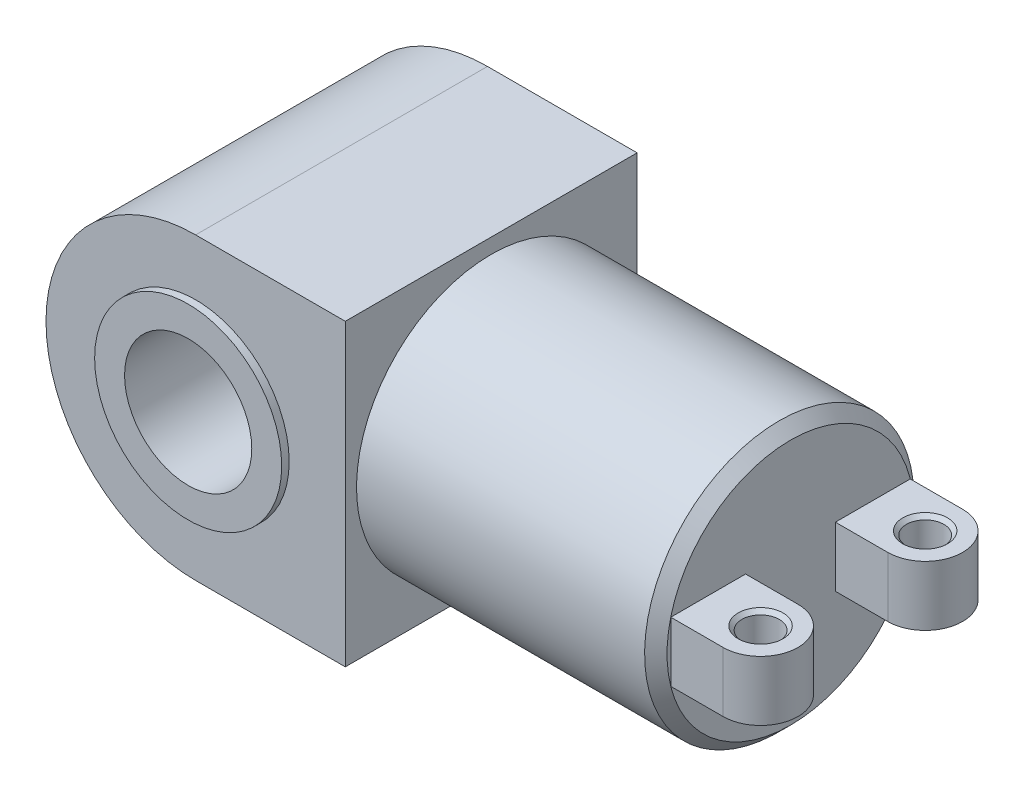
ISO-10303-21;
HEADER;
FILE_DESCRIPTION(('STEP AP214'),'2;1');
FILE_NAME('part.step','',(''),(''),'','','');
FILE_SCHEMA(('AUTOMOTIVE_DESIGN { 1 0 10303 214 1 1 1 1 }'));
ENDSEC;
DATA;
#1=APPLICATION_CONTEXT('core data for automotive mechanical design processes');
#2=APPLICATION_PROTOCOL_DEFINITION('international standard','automotive_design',2000,#1);
#3=PRODUCT_CONTEXT('',#1,'mechanical');
#4=PRODUCT('Part','Part','',(#3));
#5=PRODUCT_RELATED_PRODUCT_CATEGORY('part','',(#4));
#6=PRODUCT_DEFINITION_FORMATION('','',#4);
#7=PRODUCT_DEFINITION_CONTEXT('part definition',#1,'design');
#8=PRODUCT_DEFINITION('design','',#6,#7);
#9=PRODUCT_DEFINITION_SHAPE('','',#8);
#10=(LENGTH_UNIT() NAMED_UNIT(*) SI_UNIT(.MILLI.,.METRE.));
#11=(NAMED_UNIT(*) PLANE_ANGLE_UNIT() SI_UNIT($,.RADIAN.));
#12=(NAMED_UNIT(*) SI_UNIT($,.STERADIAN.) SOLID_ANGLE_UNIT());
#13=UNCERTAINTY_MEASURE_WITH_UNIT(LENGTH_MEASURE(1.E-05),#10,'distance_accuracy_value','');
#14=(GEOMETRIC_REPRESENTATION_CONTEXT(3) GLOBAL_UNCERTAINTY_ASSIGNED_CONTEXT((#13)) GLOBAL_UNIT_ASSIGNED_CONTEXT((#10,
#11,#12)) REPRESENTATION_CONTEXT('',''));
#15=CARTESIAN_POINT('',(0.,0.,0.));
#16=DIRECTION('',(0.,0.,1.));
#17=DIRECTION('',(1.,0.,0.));
#18=AXIS2_PLACEMENT_3D('',#15,#16,#17);
#19=CARTESIAN_POINT('',(300.,0.,0.));
#20=DIRECTION('',(1.,0.,0.));
#21=DIRECTION('',(0.,1.,0.));
#22=AXIS2_PLACEMENT_3D('',#19,#20,#21);
#23=PLANE('',#22);
#24=CARTESIAN_POINT('',(300.,0.,0.));
#25=DIRECTION('',(1.,0.,0.));
#26=DIRECTION('',(0.,1.,0.));
#27=AXIS2_PLACEMENT_3D('',#24,#25,#26);
#28=CIRCLE('',#27,82.5000000000002);
#29=CARTESIAN_POINT('',(300.,82.5000000000002,0.));
#30=VERTEX_POINT('',#29);
#31=EDGE_CURVE('E208',#30,#30,#28,.T.);
#32=ORIENTED_EDGE('',*,*,#31,.T.);
#33=EDGE_LOOP('',(#32));
#34=FACE_BOUND('',#33,.T.);
#35=DIRECTION('',(0.,0.,1.));
#36=VECTOR('',#35,1.);
#37=CARTESIAN_POINT('',(300.,-20.,80.));
#38=LINE('',#37,#36);
#39=CARTESIAN_POINT('',(300.,-20.,30.));
#40=VERTEX_POINT('',#39);
#41=CARTESIAN_POINT('',(300.,-20.,80.));
#42=VERTEX_POINT('',#41);
#43=EDGE_CURVE('E65',#40,#42,#38,.T.);
#44=ORIENTED_EDGE('',*,*,#43,.T.);
#45=DIRECTION('',(0.,-1.,0.));
#46=VECTOR('',#45,1.);
#47=CARTESIAN_POINT('',(300.,20.,80.));
#48=LINE('',#47,#46);
#49=CARTESIAN_POINT('',(300.,20.,80.));
#50=VERTEX_POINT('',#49);
#51=EDGE_CURVE('E199',#50,#42,#48,.T.);
#52=ORIENTED_EDGE('',*,*,#51,.F.);
#53=DIRECTION('',(0.,0.,1.));
#54=VECTOR('',#53,1.);
#55=CARTESIAN_POINT('',(300.,20.,80.));
#56=LINE('',#55,#54);
#57=CARTESIAN_POINT('',(300.,20.,30.));
#58=VERTEX_POINT('',#57);
#59=EDGE_CURVE('E166',#58,#50,#56,.T.);
#60=ORIENTED_EDGE('',*,*,#59,.F.);
#61=DIRECTION('',(0.,-1.,0.));
#62=VECTOR('',#61,1.);
#63=CARTESIAN_POINT('',(300.,20.,30.));
#64=LINE('',#63,#62);
#65=EDGE_CURVE('E179',#58,#40,#64,.T.);
#66=ORIENTED_EDGE('',*,*,#65,.T.);
#67=EDGE_LOOP('',(#44,#52,#60,#66));
#68=FACE_BOUND('',#67,.T.);
#69=DIRECTION('',(0.,0.,1.));
#70=VECTOR('',#69,1.);
#71=CARTESIAN_POINT('',(300.,-20.,-80.));
#72=LINE('',#71,#70);
#73=CARTESIAN_POINT('',(300.,-20.,-80.));
#74=VERTEX_POINT('',#73);
#75=CARTESIAN_POINT('',(300.,-20.,-30.));
#76=VERTEX_POINT('',#75);
#77=EDGE_CURVE('E57',#74,#76,#72,.T.);
#78=ORIENTED_EDGE('',*,*,#77,.T.);
#79=DIRECTION('',(0.,-1.,0.));
#80=VECTOR('',#79,1.);
#81=CARTESIAN_POINT('',(300.,20.,-30.));
#82=LINE('',#81,#80);
#83=CARTESIAN_POINT('',(300.,20.,-30.));
#84=VERTEX_POINT('',#83);
#85=EDGE_CURVE('E137',#84,#76,#82,.T.);
#86=ORIENTED_EDGE('',*,*,#85,.F.);
#87=DIRECTION('',(0.,0.,1.));
#88=VECTOR('',#87,1.);
#89=CARTESIAN_POINT('',(300.,20.,-80.));
#90=LINE('',#89,#88);
#91=CARTESIAN_POINT('',(300.,20.,-80.));
#92=VERTEX_POINT('',#91);
#93=EDGE_CURVE('E144',#92,#84,#90,.T.);
#94=ORIENTED_EDGE('',*,*,#93,.F.);
#95=DIRECTION('',(0.,-1.,0.));
#96=VECTOR('',#95,1.);
#97=CARTESIAN_POINT('',(300.,20.,-80.));
#98=LINE('',#97,#96);
#99=EDGE_CURVE('E597',#92,#74,#98,.T.);
#100=ORIENTED_EDGE('',*,*,#99,.T.);
#101=EDGE_LOOP('',(#78,#86,#94,#100));
#102=FACE_BOUND('',#101,.T.);
#103=ADVANCED_FACE('F40',(#34,#68,#102),#23,.T.);
#104=CARTESIAN_POINT('',(0.,0.,97.5));
#105=DIRECTION('',(0.,0.,1.));
#106=DIRECTION('',(1.,0.,0.));
#107=AXIS2_PLACEMENT_3D('',#104,#105,#106);
#108=PLANE('',#107);
#109=CARTESIAN_POINT('',(0.,0.,97.5));
#110=DIRECTION('',(0.,0.,1.));
#111=DIRECTION('',(1.,0.,0.));
#112=AXIS2_PLACEMENT_3D('',#109,#110,#111);
#113=CIRCLE('',#112,62.5);
#114=CARTESIAN_POINT('',(62.5,0.,97.5));
#115=VERTEX_POINT('',#114);
#116=EDGE_CURVE('E209',#115,#115,#113,.T.);
#117=ORIENTED_EDGE('',*,*,#116,.F.);
#118=EDGE_LOOP('',(#117));
#119=FACE_BOUND('',#118,.T.);
#120=DIRECTION('',(1.,0.,0.));
#121=VECTOR('',#120,1.);
#122=CARTESIAN_POINT('',(0.,-100.,97.5));
#123=LINE('',#122,#121);
#124=CARTESIAN_POINT('',(0.,-100.,97.5));
#125=VERTEX_POINT('',#124);
#126=CARTESIAN_POINT('',(100.,-100.,97.5));
#127=VERTEX_POINT('',#126);
#128=EDGE_CURVE('E234',#125,#127,#123,.T.);
#129=ORIENTED_EDGE('',*,*,#128,.T.);
#130=DIRECTION('',(0.,1.,0.));
#131=VECTOR('',#130,1.);
#132=CARTESIAN_POINT('',(100.,100.,97.5));
#133=LINE('',#132,#131);
#134=CARTESIAN_POINT('',(100.,100.,97.5));
#135=VERTEX_POINT('',#134);
#136=EDGE_CURVE('E238',#127,#135,#133,.T.);
#137=ORIENTED_EDGE('',*,*,#136,.T.);
#138=DIRECTION('',(-1.,0.,0.));
#139=VECTOR('',#138,1.);
#140=CARTESIAN_POINT('',(100.,100.,97.5));
#141=LINE('',#140,#139);
#142=CARTESIAN_POINT('',(0.,99.9999999999999,97.5));
#143=VERTEX_POINT('',#142);
#144=EDGE_CURVE('E242',#135,#143,#141,.T.);
#145=ORIENTED_EDGE('',*,*,#144,.T.);
#146=CARTESIAN_POINT('',(0.,0.,97.5));
#147=DIRECTION('',(0.,0.,1.));
#148=DIRECTION('',(1.,0.,0.));
#149=AXIS2_PLACEMENT_3D('',#146,#147,#148);
#150=CIRCLE('',#149,100.);
#151=EDGE_CURVE('E245',#143,#125,#150,.T.);
#152=ORIENTED_EDGE('',*,*,#151,.T.);
#153=EDGE_LOOP('',(#129,#137,#145,#152));
#154=FACE_BOUND('',#153,.T.);
#155=ADVANCED_FACE('F332',(#119,#154),#108,.T.);
#156=CARTESIAN_POINT('',(0.,0.,-97.5));
#157=DIRECTION('',(0.,0.,1.));
#158=DIRECTION('',(1.,0.,0.));
#159=AXIS2_PLACEMENT_3D('',#156,#157,#158);
#160=PLANE('',#159);
#161=CARTESIAN_POINT('',(0.,0.,-97.5));
#162=DIRECTION('',(0.,0.,-1.));
#163=DIRECTION('',(-1.,0.,0.));
#164=AXIS2_PLACEMENT_3D('',#161,#162,#163);
#165=CIRCLE('',#164,62.5);
#166=CARTESIAN_POINT('',(-62.5,0.,-97.5));
#167=VERTEX_POINT('',#166);
#168=EDGE_CURVE('E221',#167,#167,#165,.T.);
#169=ORIENTED_EDGE('',*,*,#168,.F.);
#170=EDGE_LOOP('',(#169));
#171=FACE_BOUND('',#170,.T.);
#172=DIRECTION('',(1.,0.,0.));
#173=VECTOR('',#172,1.);
#174=CARTESIAN_POINT('',(0.,-100.,-97.5));
#175=LINE('',#174,#173);
#176=CARTESIAN_POINT('',(0.,-100.,-97.5));
#177=VERTEX_POINT('',#176);
#178=CARTESIAN_POINT('',(100.,-100.,-97.5));
#179=VERTEX_POINT('',#178);
#180=EDGE_CURVE('E229',#177,#179,#175,.T.);
#181=ORIENTED_EDGE('',*,*,#180,.F.);
#182=CARTESIAN_POINT('',(0.,0.,-97.5));
#183=DIRECTION('',(0.,0.,1.));
#184=DIRECTION('',(1.,0.,0.));
#185=AXIS2_PLACEMENT_3D('',#182,#183,#184);
#186=CIRCLE('',#185,100.);
#187=CARTESIAN_POINT('',(0.,99.9999999999999,-97.5));
#188=VERTEX_POINT('',#187);
#189=EDGE_CURVE('E239',#188,#177,#186,.T.);
#190=ORIENTED_EDGE('',*,*,#189,.F.);
#191=DIRECTION('',(-1.,0.,0.));
#192=VECTOR('',#191,1.);
#193=CARTESIAN_POINT('',(100.,100.,-97.5));
#194=LINE('',#193,#192);
#195=CARTESIAN_POINT('',(100.,100.,-97.5));
#196=VERTEX_POINT('',#195);
#197=EDGE_CURVE('E255',#196,#188,#194,.T.);
#198=ORIENTED_EDGE('',*,*,#197,.F.);
#199=DIRECTION('',(0.,1.,0.));
#200=VECTOR('',#199,1.);
#201=CARTESIAN_POINT('',(100.,100.,-97.5));
#202=LINE('',#201,#200);
#203=EDGE_CURVE('E252',#179,#196,#202,.T.);
#204=ORIENTED_EDGE('',*,*,#203,.F.);
#205=EDGE_LOOP('',(#181,#190,#198,#204));
#206=FACE_BOUND('',#205,.T.);
#207=ADVANCED_FACE('F340',(#171,#206),#160,.F.);
#208=CARTESIAN_POINT('',(0.,-100.,97.5));
#209=DIRECTION('',(0.,1.,0.));
#210=DIRECTION('',(0.,0.,1.));
#211=AXIS2_PLACEMENT_3D('',#208,#209,#210);
#212=PLANE('',#211);
#213=ORIENTED_EDGE('',*,*,#180,.T.);
#214=DIRECTION('',(0.,0.,-1.));
#215=VECTOR('',#214,1.);
#216=CARTESIAN_POINT('',(100.,-100.,97.5));
#217=LINE('',#216,#215);
#218=EDGE_CURVE('E233',#127,#179,#217,.T.);
#219=ORIENTED_EDGE('',*,*,#218,.F.);
#220=ORIENTED_EDGE('',*,*,#128,.F.);
#221=DIRECTION('',(0.,0.,-1.));
#222=VECTOR('',#221,1.);
#223=CARTESIAN_POINT('',(0.,-100.,97.5));
#224=LINE('',#223,#222);
#225=EDGE_CURVE('E248',#125,#177,#224,.T.);
#226=ORIENTED_EDGE('',*,*,#225,.T.);
#227=EDGE_LOOP('',(#213,#219,#220,#226));
#228=FACE_BOUND('',#227,.T.);
#229=ADVANCED_FACE('F375',(#228),#212,.F.);
#230=CARTESIAN_POINT('',(100.,100.,97.5));
#231=DIRECTION('',(-1.,0.,0.));
#232=DIRECTION('',(0.,-1.,0.));
#233=AXIS2_PLACEMENT_3D('',#230,#231,#232);
#234=PLANE('',#233);
#235=CARTESIAN_POINT('',(100.,0.,0.));
#236=DIRECTION('',(1.,0.,0.));
#237=DIRECTION('',(0.,1.,0.));
#238=AXIS2_PLACEMENT_3D('',#235,#236,#237);
#239=CIRCLE('',#238,90.);
#240=CARTESIAN_POINT('',(100.,90.,0.));
#241=VERTEX_POINT('',#240);
#242=EDGE_CURVE('E204',#241,#241,#239,.T.);
#243=ORIENTED_EDGE('',*,*,#242,.F.);
#244=EDGE_LOOP('',(#243));
#245=FACE_BOUND('',#244,.T.);
#246=ORIENTED_EDGE('',*,*,#203,.T.);
#247=DIRECTION('',(0.,0.,-1.));
#248=VECTOR('',#247,1.);
#249=CARTESIAN_POINT('',(100.,100.,97.5));
#250=LINE('',#249,#248);
#251=EDGE_CURVE('E267',#135,#196,#250,.T.);
#252=ORIENTED_EDGE('',*,*,#251,.F.);
#253=ORIENTED_EDGE('',*,*,#136,.F.);
#254=ORIENTED_EDGE('',*,*,#218,.T.);
#255=EDGE_LOOP('',(#246,#252,#253,#254));
#256=FACE_BOUND('',#255,.T.);
#257=ADVANCED_FACE('F383',(#245,#256),#234,.F.);
#258=CARTESIAN_POINT('',(100.,100.,97.5));
#259=DIRECTION('',(0.,-1.,0.));
#260=DIRECTION('',(1.,0.,0.));
#261=AXIS2_PLACEMENT_3D('',#258,#259,#260);
#262=PLANE('',#261);
#263=ORIENTED_EDGE('',*,*,#197,.T.);
#264=DIRECTION('',(0.,0.,-1.));
#265=VECTOR('',#264,1.);
#266=CARTESIAN_POINT('',(0.,99.9999999999999,97.5));
#267=LINE('',#266,#265);
#268=EDGE_CURVE('E263',#143,#188,#267,.T.);
#269=ORIENTED_EDGE('',*,*,#268,.F.);
#270=ORIENTED_EDGE('',*,*,#144,.F.);
#271=ORIENTED_EDGE('',*,*,#251,.T.);
#272=EDGE_LOOP('',(#263,#269,#270,#271));
#273=FACE_BOUND('',#272,.T.);
#274=ADVANCED_FACE('F379',(#273),#262,.F.);
#275=CARTESIAN_POINT('',(0.,0.,97.5));
#276=DIRECTION('',(0.,0.,-1.));
#277=DIRECTION('',(-1.,0.,0.));
#278=AXIS2_PLACEMENT_3D('',#275,#276,#277);
#279=CYLINDRICAL_SURFACE('',#278,100.);
#280=ORIENTED_EDGE('',*,*,#189,.T.);
#281=ORIENTED_EDGE('',*,*,#225,.F.);
#282=ORIENTED_EDGE('',*,*,#151,.F.);
#283=ORIENTED_EDGE('',*,*,#268,.T.);
#284=EDGE_LOOP('',(#280,#281,#282,#283));
#285=FACE_BOUND('',#284,.T.);
#286=ADVANCED_FACE('F370',(#285),#279,.T.);
#287=CARTESIAN_POINT('',(0.,0.,97.5));
#288=DIRECTION('',(0.,0.,-1.));
#289=DIRECTION('',(-1.,0.,0.));
#290=AXIS2_PLACEMENT_3D('',#287,#288,#289);
#291=CYLINDRICAL_SURFACE('',#290,42.5);
#292=CARTESIAN_POINT('',(0.,0.,-102.5));
#293=DIRECTION('',(0.,0.,-1.));
#294=DIRECTION('',(-1.,0.,0.));
#295=AXIS2_PLACEMENT_3D('',#292,#293,#294);
#296=CIRCLE('',#295,42.5);
#297=CARTESIAN_POINT('',(-42.5,0.,-102.5));
#298=VERTEX_POINT('',#297);
#299=EDGE_CURVE('E217',#298,#298,#296,.T.);
#300=ORIENTED_EDGE('',*,*,#299,.T.);
#301=EDGE_LOOP('',(#300));
#302=FACE_BOUND('',#301,.T.);
#303=CARTESIAN_POINT('',(0.,0.,102.5));
#304=DIRECTION('',(0.,0.,1.));
#305=DIRECTION('',(1.,0.,0.));
#306=AXIS2_PLACEMENT_3D('',#303,#304,#305);
#307=CIRCLE('',#306,42.5);
#308=CARTESIAN_POINT('',(42.5,0.,102.5));
#309=VERTEX_POINT('',#308);
#310=EDGE_CURVE('E203',#309,#309,#307,.T.);
#311=ORIENTED_EDGE('',*,*,#310,.T.);
#312=EDGE_LOOP('',(#311));
#313=FACE_BOUND('',#312,.T.);
#314=ADVANCED_FACE('F364',(#302,#313),#291,.F.);
#315=CARTESIAN_POINT('',(0.,0.,-102.5));
#316=DIRECTION('',(0.,0.,-1.));
#317=DIRECTION('',(-1.,0.,0.));
#318=AXIS2_PLACEMENT_3D('',#315,#316,#317);
#319=PLANE('',#318);
#320=CARTESIAN_POINT('',(0.,0.,-102.5));
#321=DIRECTION('',(0.,0.,-1.));
#322=DIRECTION('',(-1.,0.,0.));
#323=AXIS2_PLACEMENT_3D('',#320,#321,#322);
#324=CIRCLE('',#323,62.5);
#325=CARTESIAN_POINT('',(-62.5,0.,-102.5));
#326=VERTEX_POINT('',#325);
#327=EDGE_CURVE('E225',#326,#326,#324,.T.);
#328=ORIENTED_EDGE('',*,*,#327,.T.);
#329=EDGE_LOOP('',(#328));
#330=FACE_BOUND('',#329,.T.);
#331=ORIENTED_EDGE('',*,*,#299,.F.);
#332=EDGE_LOOP('',(#331));
#333=FACE_BOUND('',#332,.T.);
#334=ADVANCED_FACE('F361',(#330,#333),#319,.T.);
#335=CARTESIAN_POINT('',(0.,0.,-102.5));
#336=DIRECTION('',(0.,0.,1.));
#337=DIRECTION('',(1.,0.,0.));
#338=AXIS2_PLACEMENT_3D('',#335,#336,#337);
#339=CYLINDRICAL_SURFACE('',#338,62.5);
#340=ORIENTED_EDGE('',*,*,#327,.F.);
#341=EDGE_LOOP('',(#340));
#342=FACE_BOUND('',#341,.T.);
#343=ORIENTED_EDGE('',*,*,#168,.T.);
#344=EDGE_LOOP('',(#343));
#345=FACE_BOUND('',#344,.T.);
#346=ADVANCED_FACE('F356',(#342,#345),#339,.T.);
#347=CARTESIAN_POINT('',(0.,0.,102.5));
#348=DIRECTION('',(0.,0.,1.));
#349=DIRECTION('',(1.,0.,0.));
#350=AXIS2_PLACEMENT_3D('',#347,#348,#349);
#351=PLANE('',#350);
#352=CARTESIAN_POINT('',(0.,0.,102.5));
#353=DIRECTION('',(0.,0.,1.));
#354=DIRECTION('',(1.,0.,0.));
#355=AXIS2_PLACEMENT_3D('',#352,#353,#354);
#356=CIRCLE('',#355,62.5);
#357=CARTESIAN_POINT('',(62.5,0.,102.5));
#358=VERTEX_POINT('',#357);
#359=EDGE_CURVE('E213',#358,#358,#356,.T.);
#360=ORIENTED_EDGE('',*,*,#359,.T.);
#361=EDGE_LOOP('',(#360));
#362=FACE_BOUND('',#361,.T.);
#363=ORIENTED_EDGE('',*,*,#310,.F.);
#364=EDGE_LOOP('',(#363));
#365=FACE_BOUND('',#364,.T.);
#366=ADVANCED_FACE('F353',(#362,#365),#351,.T.);
#367=CARTESIAN_POINT('',(0.,0.,102.5));
#368=DIRECTION('',(0.,0.,-1.));
#369=DIRECTION('',(-1.,0.,0.));
#370=AXIS2_PLACEMENT_3D('',#367,#368,#369);
#371=CYLINDRICAL_SURFACE('',#370,62.5);
#372=ORIENTED_EDGE('',*,*,#359,.F.);
#373=EDGE_LOOP('',(#372));
#374=FACE_BOUND('',#373,.T.);
#375=ORIENTED_EDGE('',*,*,#116,.T.);
#376=EDGE_LOOP('',(#375));
#377=FACE_BOUND('',#376,.T.);
#378=ADVANCED_FACE('F351',(#374,#377),#371,.T.);
#379=CARTESIAN_POINT('',(300.,0.,0.));
#380=DIRECTION('',(-1.,0.,0.));
#381=DIRECTION('',(0.,-1.,0.));
#382=AXIS2_PLACEMENT_3D('',#379,#380,#381);
#383=CYLINDRICAL_SURFACE('',#382,90.);
#384=CARTESIAN_POINT('',(292.5,0.,0.));
#385=DIRECTION('',(1.,0.,0.));
#386=DIRECTION('',(0.,1.,0.));
#387=AXIS2_PLACEMENT_3D('',#384,#385,#386);
#388=CIRCLE('',#387,90.);
#389=CARTESIAN_POINT('',(292.5,90.0000000000001,0.));
#390=VERTEX_POINT('',#389);
#391=EDGE_CURVE('E277',#390,#390,#388,.F.);
#392=ORIENTED_EDGE('',*,*,#391,.T.);
#393=EDGE_LOOP('',(#392));
#394=FACE_BOUND('',#393,.T.);
#395=ORIENTED_EDGE('',*,*,#242,.T.);
#396=EDGE_LOOP('',(#395));
#397=FACE_BOUND('',#396,.T.);
#398=ADVANCED_FACE('F348',(#394,#397),#383,.T.);
#399=CARTESIAN_POINT('',(335.,20.,55.));
#400=DIRECTION('',(0.,1.,0.));
#401=DIRECTION('',(0.,0.,1.));
#402=AXIS2_PLACEMENT_3D('',#399,#400,#401);
#403=PLANE('',#402);
#404=CARTESIAN_POINT('',(335.,20.,55.));
#405=DIRECTION('',(0.,1.,0.));
#406=DIRECTION('',(0.,0.,1.));
#407=AXIS2_PLACEMENT_3D('',#404,#405,#406);
#408=CIRCLE('',#407,15.0000000000002);
#409=CARTESIAN_POINT('',(335.,20.,70.0000000000002));
#410=VERTEX_POINT('',#409);
#411=EDGE_CURVE('E293',#410,#410,#408,.F.);
#412=ORIENTED_EDGE('',*,*,#411,.T.);
#413=EDGE_LOOP('',(#412));
#414=FACE_BOUND('',#413,.T.);
#415=ORIENTED_EDGE('',*,*,#59,.T.);
#416=DIRECTION('',(1.,0.,0.));
#417=VECTOR('',#416,1.);
#418=CARTESIAN_POINT('',(300.,20.,80.));
#419=LINE('',#418,#417);
#420=CARTESIAN_POINT('',(335.,20.,80.));
#421=VERTEX_POINT('',#420);
#422=EDGE_CURVE('E170',#50,#421,#419,.T.);
#423=ORIENTED_EDGE('',*,*,#422,.T.);
#424=CARTESIAN_POINT('',(335.,20.,55.));
#425=DIRECTION('',(0.,1.,0.));
#426=DIRECTION('',(0.,0.,1.));
#427=AXIS2_PLACEMENT_3D('',#424,#425,#426);
#428=CIRCLE('',#427,25.);
#429=CARTESIAN_POINT('',(335.,20.,30.));
#430=VERTEX_POINT('',#429);
#431=EDGE_CURVE('E174',#421,#430,#428,.T.);
#432=ORIENTED_EDGE('',*,*,#431,.T.);
#433=DIRECTION('',(-1.,0.,0.));
#434=VECTOR('',#433,1.);
#435=CARTESIAN_POINT('',(300.,20.,30.));
#436=LINE('',#435,#434);
#437=EDGE_CURVE('E177',#430,#58,#436,.T.);
#438=ORIENTED_EDGE('',*,*,#437,.T.);
#439=EDGE_LOOP('',(#415,#423,#432,#438));
#440=FACE_BOUND('',#439,.T.);
#441=ADVANCED_FACE('F350',(#414,#440),#403,.T.);
#442=CARTESIAN_POINT('',(335.,-20.,55.));
#443=DIRECTION('',(0.,1.,0.));
#444=DIRECTION('',(0.,0.,1.));
#445=AXIS2_PLACEMENT_3D('',#442,#443,#444);
#446=PLANE('',#445);
#447=CARTESIAN_POINT('',(335.,-20.,55.));
#448=DIRECTION('',(0.,1.,0.));
#449=DIRECTION('',(0.,0.,1.));
#450=AXIS2_PLACEMENT_3D('',#447,#448,#449);
#451=CIRCLE('',#450,15.);
#452=CARTESIAN_POINT('',(335.,-20.,70.));
#453=VERTEX_POINT('',#452);
#454=EDGE_CURVE('E281',#453,#453,#451,.T.);
#455=ORIENTED_EDGE('',*,*,#454,.T.);
#456=EDGE_LOOP('',(#455));
#457=FACE_BOUND('',#456,.T.);
#458=ORIENTED_EDGE('',*,*,#43,.F.);
#459=DIRECTION('',(-1.,0.,0.));
#460=VECTOR('',#459,1.);
#461=CARTESIAN_POINT('',(300.,-20.,30.));
#462=LINE('',#461,#460);
#463=CARTESIAN_POINT('',(335.,-20.,30.));
#464=VERTEX_POINT('',#463);
#465=EDGE_CURVE('E171',#464,#40,#462,.T.);
#466=ORIENTED_EDGE('',*,*,#465,.F.);
#467=CARTESIAN_POINT('',(335.,-20.,55.));
#468=DIRECTION('',(0.,1.,0.));
#469=DIRECTION('',(0.,0.,1.));
#470=AXIS2_PLACEMENT_3D('',#467,#468,#469);
#471=CIRCLE('',#470,25.);
#472=CARTESIAN_POINT('',(335.,-20.,80.));
#473=VERTEX_POINT('',#472);
#474=EDGE_CURVE('E183',#473,#464,#471,.T.);
#475=ORIENTED_EDGE('',*,*,#474,.F.);
#476=DIRECTION('',(1.,0.,0.));
#477=VECTOR('',#476,1.);
#478=CARTESIAN_POINT('',(300.,-20.,80.));
#479=LINE('',#478,#477);
#480=EDGE_CURVE('E160',#42,#473,#479,.T.);
#481=ORIENTED_EDGE('',*,*,#480,.F.);
#482=EDGE_LOOP('',(#458,#466,#475,#481));
#483=FACE_BOUND('',#482,.T.);
#484=ADVANCED_FACE('F436',(#457,#483),#446,.F.);
#485=CARTESIAN_POINT('',(300.,20.,80.));
#486=DIRECTION('',(0.,0.,-1.));
#487=DIRECTION('',(-1.,0.,0.));
#488=AXIS2_PLACEMENT_3D('',#485,#486,#487);
#489=PLANE('',#488);
#490=ORIENTED_EDGE('',*,*,#480,.T.);
#491=DIRECTION('',(0.,-1.,0.));
#492=VECTOR('',#491,1.);
#493=CARTESIAN_POINT('',(335.,20.,80.));
#494=LINE('',#493,#492);
#495=EDGE_CURVE('E195',#421,#473,#494,.T.);
#496=ORIENTED_EDGE('',*,*,#495,.F.);
#497=ORIENTED_EDGE('',*,*,#422,.F.);
#498=ORIENTED_EDGE('',*,*,#51,.T.);
#499=EDGE_LOOP('',(#490,#496,#497,#498));
#500=FACE_BOUND('',#499,.T.);
#501=ADVANCED_FACE('F346',(#500),#489,.F.);
#502=CARTESIAN_POINT('',(335.,20.,55.));
#503=DIRECTION('',(0.,-1.,0.));
#504=DIRECTION('',(0.,0.,-1.));
#505=AXIS2_PLACEMENT_3D('',#502,#503,#504);
#506=CYLINDRICAL_SURFACE('',#505,25.);
#507=ORIENTED_EDGE('',*,*,#474,.T.);
#508=DIRECTION('',(0.,-1.,0.));
#509=VECTOR('',#508,1.);
#510=CARTESIAN_POINT('',(335.,20.,30.));
#511=LINE('',#510,#509);
#512=EDGE_CURVE('E191',#430,#464,#511,.T.);
#513=ORIENTED_EDGE('',*,*,#512,.F.);
#514=ORIENTED_EDGE('',*,*,#431,.F.);
#515=ORIENTED_EDGE('',*,*,#495,.T.);
#516=EDGE_LOOP('',(#507,#513,#514,#515));
#517=FACE_BOUND('',#516,.T.);
#518=ADVANCED_FACE('F429',(#517),#506,.T.);
#519=CARTESIAN_POINT('',(300.,20.,30.));
#520=DIRECTION('',(0.,0.,1.));
#521=DIRECTION('',(1.,0.,0.));
#522=AXIS2_PLACEMENT_3D('',#519,#520,#521);
#523=PLANE('',#522);
#524=ORIENTED_EDGE('',*,*,#465,.T.);
#525=ORIENTED_EDGE('',*,*,#65,.F.);
#526=ORIENTED_EDGE('',*,*,#437,.F.);
#527=ORIENTED_EDGE('',*,*,#512,.T.);
#528=EDGE_LOOP('',(#524,#525,#526,#527));
#529=FACE_BOUND('',#528,.T.);
#530=ADVANCED_FACE('F422',(#529),#523,.F.);
#531=CARTESIAN_POINT('',(335.,20.,55.));
#532=DIRECTION('',(0.,-1.,0.));
#533=DIRECTION('',(0.,0.,-1.));
#534=AXIS2_PLACEMENT_3D('',#531,#532,#533);
#535=CYLINDRICAL_SURFACE('',#534,12.5);
#536=CARTESIAN_POINT('',(335.,-17.5,55.));
#537=DIRECTION('',(0.,1.,0.));
#538=DIRECTION('',(0.,0.,1.));
#539=AXIS2_PLACEMENT_3D('',#536,#537,#538);
#540=CIRCLE('',#539,12.5);
#541=CARTESIAN_POINT('',(335.,-17.5,67.5));
#542=VERTEX_POINT('',#541);
#543=EDGE_CURVE('E289',#542,#542,#540,.F.);
#544=ORIENTED_EDGE('',*,*,#543,.T.);
#545=EDGE_LOOP('',(#544));
#546=FACE_BOUND('',#545,.T.);
#547=CARTESIAN_POINT('',(335.,17.4999999999998,55.));
#548=DIRECTION('',(0.,1.,0.));
#549=DIRECTION('',(0.,0.,1.));
#550=AXIS2_PLACEMENT_3D('',#547,#548,#549);
#551=CIRCLE('',#550,12.5);
#552=CARTESIAN_POINT('',(335.,17.4999999999998,67.5));
#553=VERTEX_POINT('',#552);
#554=EDGE_CURVE('E285',#553,#553,#551,.T.);
#555=ORIENTED_EDGE('',*,*,#554,.T.);
#556=EDGE_LOOP('',(#555));
#557=FACE_BOUND('',#556,.T.);
#558=ADVANCED_FACE('F327',(#546,#557),#535,.F.);
#559=CARTESIAN_POINT('',(335.,20.,-55.));
#560=DIRECTION('',(0.,1.,0.));
#561=DIRECTION('',(0.,0.,1.));
#562=AXIS2_PLACEMENT_3D('',#559,#560,#561);
#563=PLANE('',#562);
#564=CARTESIAN_POINT('',(335.,20.,-55.));
#565=DIRECTION('',(0.,1.,0.));
#566=DIRECTION('',(0.,0.,1.));
#567=AXIS2_PLACEMENT_3D('',#564,#565,#566);
#568=CIRCLE('',#567,15.0000000000001);
#569=CARTESIAN_POINT('',(335.,20.,-39.9999999999999));
#570=VERTEX_POINT('',#569);
#571=EDGE_CURVE('E11',#570,#570,#568,.F.);
#572=ORIENTED_EDGE('',*,*,#571,.T.);
#573=EDGE_LOOP('',(#572));
#574=FACE_BOUND('',#573,.T.);
#575=ORIENTED_EDGE('',*,*,#93,.T.);
#576=DIRECTION('',(1.,0.,0.));
#577=VECTOR('',#576,1.);
#578=CARTESIAN_POINT('',(300.,20.,-30.));
#579=LINE('',#578,#577);
#580=CARTESIAN_POINT('',(335.,20.,-30.));
#581=VERTEX_POINT('',#580);
#582=EDGE_CURVE('E133',#84,#581,#579,.T.);
#583=ORIENTED_EDGE('',*,*,#582,.T.);
#584=CARTESIAN_POINT('',(335.,20.,-55.));
#585=DIRECTION('',(0.,1.,0.));
#586=DIRECTION('',(0.,0.,1.));
#587=AXIS2_PLACEMENT_3D('',#584,#585,#586);
#588=CIRCLE('',#587,25.);
#589=CARTESIAN_POINT('',(335.,20.,-80.));
#590=VERTEX_POINT('',#589);
#591=EDGE_CURVE('E143',#581,#590,#588,.T.);
#592=ORIENTED_EDGE('',*,*,#591,.T.);
#593=DIRECTION('',(-1.,0.,0.));
#594=VECTOR('',#593,1.);
#595=CARTESIAN_POINT('',(300.,20.,-80.));
#596=LINE('',#595,#594);
#597=EDGE_CURVE('E149',#590,#92,#596,.T.);
#598=ORIENTED_EDGE('',*,*,#597,.T.);
#599=EDGE_LOOP('',(#575,#583,#592,#598));
#600=FACE_BOUND('',#599,.T.);
#601=ADVANCED_FACE('F147',(#574,#600),#563,.T.);
#602=CARTESIAN_POINT('',(335.,-20.,-55.));
#603=DIRECTION('',(0.,1.,0.));
#604=DIRECTION('',(0.,0.,1.));
#605=AXIS2_PLACEMENT_3D('',#602,#603,#604);
#606=PLANE('',#605);
#607=CARTESIAN_POINT('',(335.,-20.,-55.));
#608=DIRECTION('',(0.,1.,0.));
#609=DIRECTION('',(0.,0.,1.));
#610=AXIS2_PLACEMENT_3D('',#607,#608,#609);
#611=CIRCLE('',#610,15.0000000000001);
#612=CARTESIAN_POINT('',(335.,-20.,-39.9999999999999));
#613=VERTEX_POINT('',#612);
#614=EDGE_CURVE('E297',#613,#613,#611,.T.);
#615=ORIENTED_EDGE('',*,*,#614,.T.);
#616=EDGE_LOOP('',(#615));
#617=FACE_BOUND('',#616,.T.);
#618=ORIENTED_EDGE('',*,*,#77,.F.);
#619=DIRECTION('',(-1.,0.,0.));
#620=VECTOR('',#619,1.);
#621=CARTESIAN_POINT('',(300.,-20.,-80.));
#622=LINE('',#621,#620);
#623=CARTESIAN_POINT('',(335.,-20.,-80.));
#624=VERTEX_POINT('',#623);
#625=EDGE_CURVE('E154',#624,#74,#622,.T.);
#626=ORIENTED_EDGE('',*,*,#625,.F.);
#627=CARTESIAN_POINT('',(335.,-20.,-55.));
#628=DIRECTION('',(0.,1.,0.));
#629=DIRECTION('',(0.,0.,1.));
#630=AXIS2_PLACEMENT_3D('',#627,#628,#629);
#631=CIRCLE('',#630,25.);
#632=CARTESIAN_POINT('',(335.,-20.,-30.));
#633=VERTEX_POINT('',#632);
#634=EDGE_CURVE('E601',#633,#624,#631,.T.);
#635=ORIENTED_EDGE('',*,*,#634,.F.);
#636=DIRECTION('',(1.,0.,0.));
#637=VECTOR('',#636,1.);
#638=CARTESIAN_POINT('',(300.,-20.,-30.));
#639=LINE('',#638,#637);
#640=EDGE_CURVE('E611',#76,#633,#639,.T.);
#641=ORIENTED_EDGE('',*,*,#640,.F.);
#642=EDGE_LOOP('',(#618,#626,#635,#641));
#643=FACE_BOUND('',#642,.T.);
#644=ADVANCED_FACE('F317',(#617,#643),#606,.F.);
#645=CARTESIAN_POINT('',(300.,20.,-30.));
#646=DIRECTION('',(0.,0.,-1.));
#647=DIRECTION('',(-1.,0.,0.));
#648=AXIS2_PLACEMENT_3D('',#645,#646,#647);
#649=PLANE('',#648);
#650=ORIENTED_EDGE('',*,*,#640,.T.);
#651=DIRECTION('',(0.,-1.,0.));
#652=VECTOR('',#651,1.);
#653=CARTESIAN_POINT('',(335.,20.,-30.));
#654=LINE('',#653,#652);
#655=EDGE_CURVE('E139',#581,#633,#654,.T.);
#656=ORIENTED_EDGE('',*,*,#655,.F.);
#657=ORIENTED_EDGE('',*,*,#582,.F.);
#658=ORIENTED_EDGE('',*,*,#85,.T.);
#659=EDGE_LOOP('',(#650,#656,#657,#658));
#660=FACE_BOUND('',#659,.T.);
#661=ADVANCED_FACE('F135',(#660),#649,.F.);
#662=CARTESIAN_POINT('',(335.,20.,-55.));
#663=DIRECTION('',(0.,-1.,0.));
#664=DIRECTION('',(0.,0.,-1.));
#665=AXIS2_PLACEMENT_3D('',#662,#663,#664);
#666=CYLINDRICAL_SURFACE('',#665,25.);
#667=ORIENTED_EDGE('',*,*,#634,.T.);
#668=DIRECTION('',(0.,-1.,0.));
#669=VECTOR('',#668,1.);
#670=CARTESIAN_POINT('',(335.,20.,-80.));
#671=LINE('',#670,#669);
#672=EDGE_CURVE('E162',#590,#624,#671,.T.);
#673=ORIENTED_EDGE('',*,*,#672,.F.);
#674=ORIENTED_EDGE('',*,*,#591,.F.);
#675=ORIENTED_EDGE('',*,*,#655,.T.);
#676=EDGE_LOOP('',(#667,#673,#674,#675));
#677=FACE_BOUND('',#676,.T.);
#678=ADVANCED_FACE('F325',(#677),#666,.T.);
#679=CARTESIAN_POINT('',(300.,20.,-80.));
#680=DIRECTION('',(0.,0.,1.));
#681=DIRECTION('',(1.,0.,0.));
#682=AXIS2_PLACEMENT_3D('',#679,#680,#681);
#683=PLANE('',#682);
#684=ORIENTED_EDGE('',*,*,#625,.T.);
#685=ORIENTED_EDGE('',*,*,#99,.F.);
#686=ORIENTED_EDGE('',*,*,#597,.F.);
#687=ORIENTED_EDGE('',*,*,#672,.T.);
#688=EDGE_LOOP('',(#684,#685,#686,#687));
#689=FACE_BOUND('',#688,.T.);
#690=ADVANCED_FACE('F590',(#689),#683,.F.);
#691=CARTESIAN_POINT('',(335.,20.,-55.));
#692=DIRECTION('',(0.,-1.,0.));
#693=DIRECTION('',(0.,0.,-1.));
#694=AXIS2_PLACEMENT_3D('',#691,#692,#693);
#695=CYLINDRICAL_SURFACE('',#694,12.5);
#696=CARTESIAN_POINT('',(335.,-17.4999999999999,-55.));
#697=DIRECTION('',(0.,1.,0.));
#698=DIRECTION('',(0.,0.,1.));
#699=AXIS2_PLACEMENT_3D('',#696,#697,#698);
#700=CIRCLE('',#699,12.5);
#701=CARTESIAN_POINT('',(335.,-17.4999999999999,-42.5));
#702=VERTEX_POINT('',#701);
#703=EDGE_CURVE('E50',#702,#702,#700,.F.);
#704=ORIENTED_EDGE('',*,*,#703,.T.);
#705=EDGE_LOOP('',(#704));
#706=FACE_BOUND('',#705,.T.);
#707=CARTESIAN_POINT('',(335.,17.5,-55.));
#708=DIRECTION('',(0.,1.,0.));
#709=DIRECTION('',(0.,0.,1.));
#710=AXIS2_PLACEMENT_3D('',#707,#708,#709);
#711=CIRCLE('',#710,12.5);
#712=CARTESIAN_POINT('',(335.,17.5,-42.5));
#713=VERTEX_POINT('',#712);
#714=EDGE_CURVE('E301',#713,#713,#711,.T.);
#715=ORIENTED_EDGE('',*,*,#714,.T.);
#716=EDGE_LOOP('',(#715));
#717=FACE_BOUND('',#716,.T.);
#718=ADVANCED_FACE('F308',(#706,#717),#695,.F.);
#719=CARTESIAN_POINT('',(300.,0.,0.));
#720=DIRECTION('',(-1.,0.,0.));
#721=DIRECTION('',(0.,-1.,0.));
#722=AXIS2_PLACEMENT_3D('',#719,#720,#721);
#723=CONICAL_SURFACE('',#722,82.5000000000002,0.785398163397446);
#724=ORIENTED_EDGE('',*,*,#391,.F.);
#725=EDGE_LOOP('',(#724));
#726=FACE_BOUND('',#725,.T.);
#727=ORIENTED_EDGE('',*,*,#31,.F.);
#728=EDGE_LOOP('',(#727));
#729=FACE_BOUND('',#728,.T.);
#730=ADVANCED_FACE('F392',(#726,#729),#723,.T.);
#731=CARTESIAN_POINT('',(335.,-20.,55.));
#732=DIRECTION('',(0.,-1.,0.));
#733=DIRECTION('',(0.,0.,-1.));
#734=AXIS2_PLACEMENT_3D('',#731,#732,#733);
#735=CONICAL_SURFACE('',#734,15.,0.785398163397454);
#736=ORIENTED_EDGE('',*,*,#543,.F.);
#737=EDGE_LOOP('',(#736));
#738=FACE_BOUND('',#737,.T.);
#739=ORIENTED_EDGE('',*,*,#454,.F.);
#740=EDGE_LOOP('',(#739));
#741=FACE_BOUND('',#740,.T.);
#742=ADVANCED_FACE('F398',(#738,#741),#735,.F.);
#743=CARTESIAN_POINT('',(335.,17.4999999999998,55.));
#744=DIRECTION('',(0.,1.,0.));
#745=DIRECTION('',(0.,0.,1.));
#746=AXIS2_PLACEMENT_3D('',#743,#744,#745);
#747=CONICAL_SURFACE('',#746,12.5,0.785398163397447);
#748=ORIENTED_EDGE('',*,*,#411,.F.);
#749=EDGE_LOOP('',(#748));
#750=FACE_BOUND('',#749,.T.);
#751=ORIENTED_EDGE('',*,*,#554,.F.);
#752=EDGE_LOOP('',(#751));
#753=FACE_BOUND('',#752,.T.);
#754=ADVANCED_FACE('F314',(#750,#753),#747,.F.);
#755=CARTESIAN_POINT('',(335.,-20.,-55.));
#756=DIRECTION('',(0.,-1.,0.));
#757=DIRECTION('',(0.,0.,-1.));
#758=AXIS2_PLACEMENT_3D('',#755,#756,#757);
#759=CONICAL_SURFACE('',#758,15.0000000000001,0.785398163397444);
#760=ORIENTED_EDGE('',*,*,#703,.F.);
#761=EDGE_LOOP('',(#760));
#762=FACE_BOUND('',#761,.T.);
#763=ORIENTED_EDGE('',*,*,#614,.F.);
#764=EDGE_LOOP('',(#763));
#765=FACE_BOUND('',#764,.T.);
#766=ADVANCED_FACE('F311',(#762,#765),#759,.F.);
#767=CARTESIAN_POINT('',(335.,17.5,-55.));
#768=DIRECTION('',(0.,1.,0.));
#769=DIRECTION('',(0.,0.,1.));
#770=AXIS2_PLACEMENT_3D('',#767,#768,#769);
#771=CONICAL_SURFACE('',#770,12.5,0.785398163397456);
#772=ORIENTED_EDGE('',*,*,#571,.F.);
#773=EDGE_LOOP('',(#772));
#774=FACE_BOUND('',#773,.T.);
#775=ORIENTED_EDGE('',*,*,#714,.F.);
#776=EDGE_LOOP('',(#775));
#777=FACE_BOUND('',#776,.T.);
#778=ADVANCED_FACE('F43',(#774,#777),#771,.F.);
#779=CLOSED_SHELL('',(#103,#155,#207,#229,#257,#274,#286,#314,#334,#346,#366,#378,#398,#441,
#484,#501,#518,#530,#558,#601,#644,#661,#678,#690,#718,#730,#742,#754,#766,#778));
#780=MANIFOLD_SOLID_BREP('B2',#779);
#781=ADVANCED_BREP_SHAPE_REPRESENTATION('',(#18,#780),#14);
#782=SHAPE_DEFINITION_REPRESENTATION(#9,#781);
ENDSEC;
END-ISO-10303-21;
